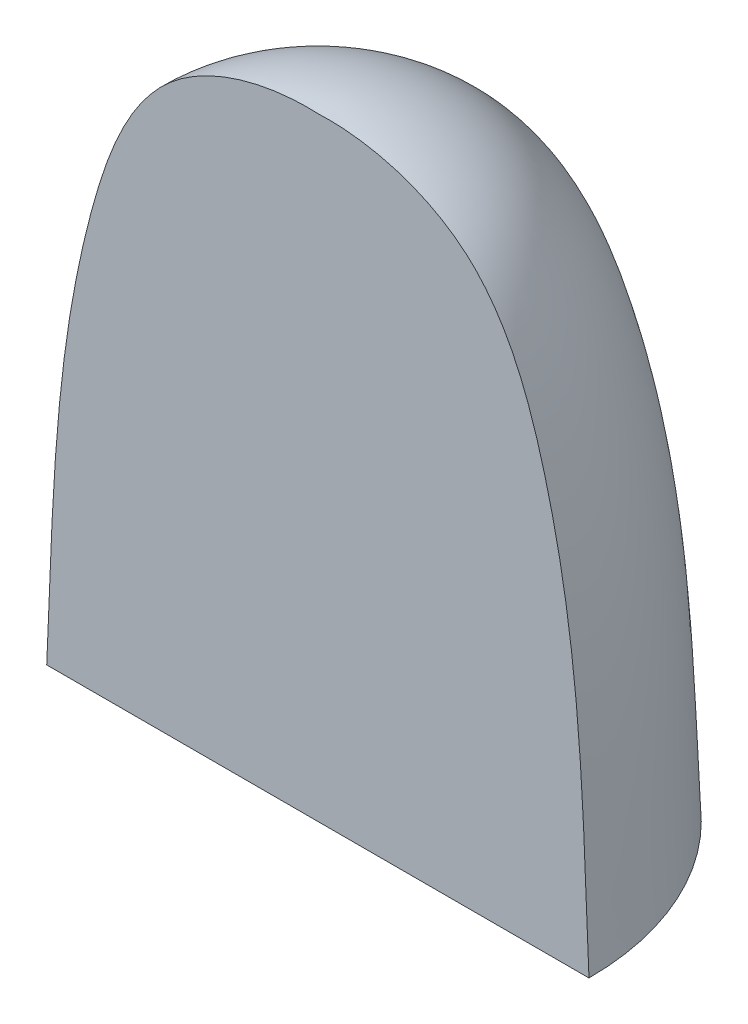
ISO-10303-21;
HEADER;
FILE_DESCRIPTION(('STEP AP214'),'2;1');
FILE_NAME('part.step','',(''),(''),'','','');
FILE_SCHEMA(('AUTOMOTIVE_DESIGN { 1 0 10303 214 1 1 1 1 }'));
ENDSEC;
DATA;
#1=APPLICATION_CONTEXT('core data for automotive mechanical design processes');
#2=APPLICATION_PROTOCOL_DEFINITION('international standard','automotive_design',2000,#1);
#3=PRODUCT_CONTEXT('',#1,'mechanical');
#4=PRODUCT('Part','Part','',(#3));
#5=PRODUCT_RELATED_PRODUCT_CATEGORY('part','',(#4));
#6=PRODUCT_DEFINITION_FORMATION('','',#4);
#7=PRODUCT_DEFINITION_CONTEXT('part definition',#1,'design');
#8=PRODUCT_DEFINITION('design','',#6,#7);
#9=PRODUCT_DEFINITION_SHAPE('','',#8);
#10=(LENGTH_UNIT() NAMED_UNIT(*) SI_UNIT(.MILLI.,.METRE.));
#11=(NAMED_UNIT(*) PLANE_ANGLE_UNIT() SI_UNIT($,.RADIAN.));
#12=(NAMED_UNIT(*) SI_UNIT($,.STERADIAN.) SOLID_ANGLE_UNIT());
#13=UNCERTAINTY_MEASURE_WITH_UNIT(LENGTH_MEASURE(1.E-05),#10,'distance_accuracy_value','');
#14=(GEOMETRIC_REPRESENTATION_CONTEXT(3) GLOBAL_UNCERTAINTY_ASSIGNED_CONTEXT((#13)) GLOBAL_UNIT_ASSIGNED_CONTEXT((#10,
#11,#12)) REPRESENTATION_CONTEXT('',''));
#15=CARTESIAN_POINT('',(0.,0.,0.));
#16=DIRECTION('',(0.,0.,1.));
#17=DIRECTION('',(1.,0.,0.));
#18=AXIS2_PLACEMENT_3D('',#15,#16,#17);
#19=CARTESIAN_POINT('',(0.,17.85,0.));
#20=CARTESIAN_POINT('',(1.24846861298638,18.0031040687306,0.));
#21=CARTESIAN_POINT('',(3.43429537377529,16.8333496800897,0.));
#22=CARTESIAN_POINT('',(6.61729731931612,10.514055415151,0.));
#23=CARTESIAN_POINT('',(6.22039885602234,4.53230718925359,0.));
#24=CARTESIAN_POINT('',(6.5,0.,0.));
#25=B_SPLINE_CURVE_WITH_KNOTS('',3,(#19,#20,#21,#22,#23,#24),.UNSPECIFIED.,.F.,.F.,(4,1,1,4),
(0.,0.174730571842795,0.328981961247271,1.),.UNSPECIFIED.);
#26=CARTESIAN_POINT('',(0.,24.0801939058172,0.));
#27=DIRECTION('',(0.,1.,0.));
#28=AXIS1_PLACEMENT('',#26,#27);
#29=SURFACE_OF_REVOLUTION('',#25,#28);
#30=CARTESIAN_POINT('',(-6.42261628933256,0.,-1.));
#31=CARTESIAN_POINT('',(-6.40999840737558,0.202144069037501,-1.));
#32=CARTESIAN_POINT('',(-6.39862298762293,0.404360225530453,-1.));
#33=CARTESIAN_POINT('',(-6.37786522635976,0.808885940270253,-1.));
#34=CARTESIAN_POINT('',(-6.3684827897175,1.01119549359677,-1.));
#35=CARTESIAN_POINT('',(-6.34242492153698,1.62198476605436,-1.));
#36=CARTESIAN_POINT('',(-6.32805579828116,2.0305597108176,-1.));
#37=CARTESIAN_POINT('',(-6.30152712698929,2.85051987310171,-1.));
#38=CARTESIAN_POINT('',(-6.2893830764119,3.26190552481192,-1.));
#39=CARTESIAN_POINT('',(-6.26366224801276,4.08630202744554,-1.));
#40=CARTESIAN_POINT('',(-6.25007987607228,4.49931272446483,-1.));
#41=CARTESIAN_POINT('',(-6.21782061477777,5.32576775294408,-1.));
#42=CARTESIAN_POINT('',(-6.1991361396311,5.73921180962271,-1.));
#43=CARTESIAN_POINT('',(-6.1521948556037,6.57970257299907,-1.));
#44=CARTESIAN_POINT('',(-6.12363388098088,7.00673329358906,-1.));
#45=CARTESIAN_POINT('',(-6.05303410165044,7.85867381750021,-1.));
#46=CARTESIAN_POINT('',(-6.01102835754578,8.28358625350202,-1.));
#47=CARTESIAN_POINT('',(-5.90944171168452,9.12998134820519,-1.));
#48=CARTESIAN_POINT('',(-5.84991790773198,9.55147064785064,-1.));
#49=CARTESIAN_POINT('',(-5.7092065861353,10.3896816415834,-1.));
#50=CARTESIAN_POINT('',(-5.62807933729757,10.806413286136,-1.));
#51=CARTESIAN_POINT('',(-5.44003731639687,11.6338666030697,-1.));
#52=CARTESIAN_POINT('',(-5.3331409204053,12.0445923379016,-0.999999999999999));
#53=CARTESIAN_POINT('',(-5.17361574848954,12.5776125719116,-1.));
#54=CARTESIAN_POINT('',(-5.13424663434977,12.7039420928548,-1.));
#55=CARTESIAN_POINT('',(-5.05252637885469,12.9557195338338,-1.));
#56=CARTESIAN_POINT('',(-5.01017350262703,13.0811668935466,-1.));
#57=CARTESIAN_POINT('',(-4.92240591057967,13.3310232714168,-1.));
#58=CARTESIAN_POINT('',(-4.87699041894009,13.4554320174358,-1.));
#59=CARTESIAN_POINT('',(-4.8065080410411,13.6411916912008,-1.));
#60=CARTESIAN_POINT('',(-4.78261270285467,13.7029889743352,-1.));
#61=CARTESIAN_POINT('',(-4.7340276019791,13.8262703325964,-1.));
#62=CARTESIAN_POINT('',(-4.70933783866417,13.8877544074764,-1.));
#63=CARTESIAN_POINT('',(-4.63396138085545,14.0716442880815,-1.));
#64=CARTESIAN_POINT('',(-4.58195710423236,14.1935153851383,-1.));
#65=CARTESIAN_POINT('',(-4.47378791119649,14.4354100975099,-1.));
#66=CARTESIAN_POINT('',(-4.41762284360768,14.5554336455053,-1.));
#67=CARTESIAN_POINT('',(-4.29951769516373,14.7950850391455,-1.));
#68=CARTESIAN_POINT('',(-4.23749763127219,14.9146736945553,-1.));
#69=CARTESIAN_POINT('',(-4.10782172505313,15.1507781678527,-1.));
#70=CARTESIAN_POINT('',(-4.04016564824958,15.2672938576295,-1.));
#71=CARTESIAN_POINT('',(-3.89858161520946,15.4965085965923,-1.));
#72=CARTESIAN_POINT('',(-3.82465218822982,15.6092067420687,-1.));
#73=CARTESIAN_POINT('',(-3.6702767933324,15.8294625018913,-1.));
#74=CARTESIAN_POINT('',(-3.58985540253065,15.9370372594243,-1.));
#75=CARTESIAN_POINT('',(-3.42189334517105,16.1464738050579,-1.));
#76=CARTESIAN_POINT('',(-3.33435389098538,16.2483365610726,-1.));
#77=CARTESIAN_POINT('',(-3.15199386499429,16.4452180483923,-1.));
#78=CARTESIAN_POINT('',(-3.05717845575063,16.5402415413145,-1.));
#79=CARTESIAN_POINT('',(-2.86916465126112,16.71441849979,-1.));
#80=CARTESIAN_POINT('',(-2.77657727593519,16.7942314439814,-1.));
#81=CARTESIAN_POINT('',(-2.5857092105719,16.9467296605872,-1.));
#82=CARTESIAN_POINT('',(-2.48742920625705,17.0194157886548,-1.));
#83=CARTESIAN_POINT('',(-2.28556893884342,17.1566932999947,-1.));
#84=CARTESIAN_POINT('',(-2.18199691142547,17.2212967521398,-1.));
#85=CARTESIAN_POINT('',(-1.96976843091663,17.3415790558771,-1.));
#86=CARTESIAN_POINT('',(-1.86111177645655,17.3972575536225,-1.));
#87=CARTESIAN_POINT('',(-1.63853535299575,17.4990221541799,-1.));
#88=CARTESIAN_POINT('',(-1.52458640545404,17.5450447308802,-1.));
#89=CARTESIAN_POINT('',(-1.29286926873105,17.6261758566657,-1.));
#90=CARTESIAN_POINT('',(-1.17510149309956,17.6612855831989,-1.));
#91=CARTESIAN_POINT('',(-0.936473393773838,17.7202490326539,-1.));
#92=CARTESIAN_POINT('',(-0.815606028256992,17.7440741836163,-1.));
#93=CARTESIAN_POINT('',(-0.572205343617627,17.7807954250336,-1.));
#94=CARTESIAN_POINT('',(-0.449671354526477,17.7936869799212,-1.));
#95=CARTESIAN_POINT('',(-0.21340062058319,17.809299632524,-1.));
#96=CARTESIAN_POINT('',(-0.0997069373888871,17.8127224603366,-1.));
#97=CARTESIAN_POINT('',(0.127650851780446,17.8120971892139,-1.));
#98=CARTESIAN_POINT('',(0.241314959649985,17.8080499424704,-1.));
#99=CARTESIAN_POINT('',(0.467849332744689,17.7917329740645,-1.));
#100=CARTESIAN_POINT('',(0.580720740450372,17.7794799453051,-1.));
#101=CARTESIAN_POINT('',(0.805059560982644,17.7456957746508,-1.));
#102=CARTESIAN_POINT('',(0.916527317150006,17.7241669488923,-1.));
#103=CARTESIAN_POINT('',(1.15155405126061,17.6679957702322,-1.));
#104=CARTESIAN_POINT('',(1.27479516410721,17.632009870832,-1.));
#105=CARTESIAN_POINT('',(1.51716789853898,17.5480877327227,-1.));
#106=CARTESIAN_POINT('',(1.63629807032919,17.5001473261037,-1.));
#107=CARTESIAN_POINT('',(1.86966339577367,17.3932427752455,-1.));
#108=CARTESIAN_POINT('',(1.9838922253933,17.334264886095,-1.));
#109=CARTESIAN_POINT('',(2.20671338376543,17.2064655586795,-1.));
#110=CARTESIAN_POINT('',(2.31530420788912,17.1376415109616,-1.));
#111=CARTESIAN_POINT('',(2.53951149442139,16.9821982743493,-1.));
#112=CARTESIAN_POINT('',(2.65433088339071,16.8944307794631,-1.));
#113=CARTESIAN_POINT('',(2.87590836958746,16.7092778113404,-1.));
#114=CARTESIAN_POINT('',(2.98266608166876,16.6118918790959,-1.));
#115=CARTESIAN_POINT('',(3.18776219117227,16.408579206145,-1.));
#116=CARTESIAN_POINT('',(3.28609774515059,16.3026496042245,-1.));
#117=CARTESIAN_POINT('',(3.47435485360609,16.0836026349269,-1.));
#118=CARTESIAN_POINT('',(3.56427620833487,15.9704850970193,-1.));
#119=CARTESIAN_POINT('',(3.78636705059933,15.6704189803899,-1.));
#120=CARTESIAN_POINT('',(3.91248433427453,15.478985340017,-1.));
#121=CARTESIAN_POINT('',(4.1471800187665,15.085619177292,-1.));
#122=CARTESIAN_POINT('',(4.25574300742439,14.8836776326821,-1.));
#123=CARTESIAN_POINT('',(4.40792608616691,14.575222747339,-1.));
#124=CARTESIAN_POINT('',(4.45694511386606,14.4713139148183,-1.));
#125=CARTESIAN_POINT('',(4.55178761609992,14.2620429582957,-1.));
#126=CARTESIAN_POINT('',(4.5976110360716,14.1566808095162,-1.));
#127=CARTESIAN_POINT('',(4.68647554251017,13.944827916199,-1.));
#128=CARTESIAN_POINT('',(4.72951733239565,13.8383374649776,-1.));
#129=CARTESIAN_POINT('',(4.81323710595821,13.6244319468778,-1.));
#130=CARTESIAN_POINT('',(4.85391504106031,13.5170168610512,-1.));
#131=CARTESIAN_POINT('',(4.96757018121328,13.2068170356862,-1.));
#132=CARTESIAN_POINT('',(5.03761233957419,13.0029494349116,-1.));
#133=CARTESIAN_POINT('',(5.16987075224262,12.5926884007881,-1.));
#134=CARTESIAN_POINT('',(5.23208639306786,12.3862947708258,-1.));
#135=CARTESIAN_POINT('',(5.34917344294296,11.9712266079175,-1.));
#136=CARTESIAN_POINT('',(5.40403782076221,11.7625500948747,-1.));
#137=CARTESIAN_POINT('',(5.50683059788724,11.3435106030181,-1.));
#138=CARTESIAN_POINT('',(5.55475909691136,11.1331476484964,-1.));
#139=CARTESIAN_POINT('',(5.6889365478829,10.4999007466791,-1.));
#140=CARTESIAN_POINT('',(5.76555017327309,10.0749574879904,-1.));
#141=CARTESIAN_POINT('',(5.89772611290117,9.21972095228717,-1.));
#142=CARTESIAN_POINT('',(5.95317982140009,8.78941147828326,-1.));
#143=CARTESIAN_POINT('',(6.04696920275435,7.9271692508611,-1.));
#144=CARTESIAN_POINT('',(6.08531223649522,7.49523727622989,-1.));
#145=CARTESIAN_POINT('',(6.14932484166554,6.63047475330309,-1.));
#146=CARTESIAN_POINT('',(6.17499423804612,6.19764419267912,-1.));
#147=CARTESIAN_POINT('',(6.22046614159332,5.28122187533568,-1.));
#148=CARTESIAN_POINT('',(6.23923879881637,4.79758233393546,-1.));
#149=CARTESIAN_POINT('',(6.27225788159768,3.83021868315066,-1.));
#150=CARTESIAN_POINT('',(6.28650475546868,3.34649458689439,-1.));
#151=CARTESIAN_POINT('',(6.31623268906044,2.38548145521528,-1.));
#152=CARTESIAN_POINT('',(6.33169492006705,1.908191978294,-0.999999999999999));
#153=CARTESIAN_POINT('',(6.36043005630438,1.19243190349366,-1.));
#154=CARTESIAN_POINT('',(6.37093308110639,0.95385601041782,-1.));
#155=CARTESIAN_POINT('',(6.39458787091519,0.4768208410554,-0.999999999999999));
#156=CARTESIAN_POINT('',(6.40773981549285,0.238361573774078,-0.999999999999997));
#157=CARTESIAN_POINT('',(6.42261628933256,0.,-0.999999999999992));
#158=B_SPLINE_CURVE_WITH_KNOTS('',3,(#30,#31,#32,#33,#34,#35,#36,#37,#38,#39,#40,#41,#42,#43,
#44,#45,#46,#47,#48,#49,#50,#51,#52,#53,#54,#55,#56,#57,#58,#59,#60,#61,#62,#63,#64,#65,#66,#67,
#68,#69,#70,#71,#72,#73,#74,#75,#76,#77,#78,#79,#80,#81,#82,#83,#84,#85,#86,#87,#88,#89,#90,#91,
#92,#93,#94,#95,#96,#97,#98,#99,#100,#101,#102,#103,#104,#105,#106,#107,#108,#109,#110,#111,
#112,#113,#114,#115,#116,#117,#118,#119,#120,#121,#122,#123,#124,#125,#126,#127,#128,#129,#130,
#131,#132,#133,#134,#135,#136,#137,#138,#139,#140,#141,#142,#143,#144,#145,#146,#147,#148,#149,
#150,#151,#152,#153,#154,#155,#156,#157),.UNSPECIFIED.,.F.,.F.,(4,2,2,2,2,2,2,2,2,2,2,2,2,2,2,2,
2,2,2,2,2,2,2,2,2,2,2,2,2,2,2,2,2,2,2,2,2,2,2,2,2,2,2,2,2,2,2,2,2,2,2,2,2,2,2,2,2,2,2,2,2,2,2,
4),(0.,0.607600927329956,1.21517284531686,2.44163004192293,3.67632914653922,4.91602023891663,
6.15756463171872,7.44136724781802,8.7220369464872,9.99857784637223,11.2715941276906,
12.5437052880018,12.9406448569127,13.3378171572839,13.7350904498138,13.9338543091148,
14.1326183249907,14.5300577884903,14.9275116994395,15.3315222071426,15.7355495313685,
16.1396718400679,16.5423301694522,16.9449200598158,17.3472268928785,17.7136257294065,
18.0799805216928,18.4457815814075,18.8115971404166,19.1797487426603,19.5478606091846,
19.9168995982495,20.2860916004342,20.6270793748566,20.9680282515405,21.3082856392783,
21.6484581150428,22.0329719438235,22.4176200203184,22.8027503231394,23.1879828838569,
23.6209564032631,24.053950594884,24.4870904001224,24.9202404852512,25.60674226431,
26.2938435371052,26.6384732328433,26.9831088114803,27.3276568948717,27.6722120558993,
28.3187207130151,28.9652800152346,29.612453380777,30.2596174408704,31.5542522872137,
32.8554453715612,34.1560781513887,35.4567288951138,36.9086820634573,38.3604913600829,
39.7930871251876,40.509494509365,41.225950475316),.UNSPECIFIED.);
#159=CARTESIAN_POINT('',(-6.42261628933256,0.,-1.));
#160=VERTEX_POINT('',#159);
#161=CARTESIAN_POINT('',(6.42261628933256,0.,-1.));
#162=VERTEX_POINT('',#161);
#163=EDGE_CURVE('E52',#160,#162,#158,.T.);
#164=ORIENTED_EDGE('',*,*,#163,.F.);
#165=CARTESIAN_POINT('',(0.,0.,0.));
#166=DIRECTION('',(0.,1.,0.));
#167=DIRECTION('',(0.,0.,1.));
#168=AXIS2_PLACEMENT_3D('',#165,#166,#167);
#169=CIRCLE('',#168,6.5);
#170=EDGE_CURVE('E55',#162,#160,#169,.T.);
#171=ORIENTED_EDGE('',*,*,#170,.F.);
#172=EDGE_LOOP('',(#164,#171));
#173=FACE_BOUND('',#172,.T.);
#174=ADVANCED_FACE('F35',(#173),#29,.T.);
#175=CARTESIAN_POINT('',(6.5,0.,0.));
#176=DIRECTION('',(0.,1.,0.));
#177=DIRECTION('',(0.,0.,1.));
#178=AXIS2_PLACEMENT_3D('',#175,#176,#177);
#179=PLANE('',#178);
#180=DIRECTION('',(1.,0.,0.));
#181=VECTOR('',#180,1.);
#182=CARTESIAN_POINT('',(-7.75,0.,-1.));
#183=LINE('',#182,#181);
#184=EDGE_CURVE('E105',#160,#162,#183,.T.);
#185=ORIENTED_EDGE('',*,*,#184,.T.);
#186=ORIENTED_EDGE('',*,*,#170,.T.);
#187=EDGE_LOOP('',(#185,#186));
#188=FACE_BOUND('',#187,.T.);
#189=DIRECTION('',(-1.,0.,0.));
#190=VECTOR('',#189,1.);
#191=CARTESIAN_POINT('',(6.5,0.,0.));
#192=LINE('',#191,#190);
#193=CARTESIAN_POINT('',(9.,0.,0.));
#194=VERTEX_POINT('',#193);
#195=CARTESIAN_POINT('',(-9.,0.,0.));
#196=VERTEX_POINT('',#195);
#197=EDGE_CURVE('E69',#194,#196,#192,.T.);
#198=ORIENTED_EDGE('',*,*,#197,.T.);
#199=CARTESIAN_POINT('',(0.,0.,0.));
#200=DIRECTION('',(0.,1.,0.));
#201=DIRECTION('',(0.,0.,1.));
#202=AXIS2_PLACEMENT_3D('',#199,#200,#201);
#203=CIRCLE('',#202,9.);
#204=EDGE_CURVE('E73',#194,#196,#203,.T.);
#205=ORIENTED_EDGE('',*,*,#204,.F.);
#206=EDGE_LOOP('',(#198,#205));
#207=FACE_BOUND('',#206,.T.);
#208=ADVANCED_FACE('F96',(#188,#207),#179,.F.);
#209=CARTESIAN_POINT('',(9.,0.,0.));
#210=CARTESIAN_POINT('',(8.79405712052161,4.78562399546529,0.));
#211=CARTESIAN_POINT('',(8.74052008463889,10.9419840515826,0.));
#212=CARTESIAN_POINT('',(5.66035992992067,19.3724701488857,0.));
#213=CARTESIAN_POINT('',(1.67596684179475,20.428176516065,0.));
#214=CARTESIAN_POINT('',(0.,20.35,0.));
#215=B_SPLINE_CURVE_WITH_KNOTS('',3,(#209,#210,#211,#212,#213,#214),.UNSPECIFIED.,.F.,.F.,(4,1,
1,4),(0.,0.559571261485386,0.790913026252223,1.),.UNSPECIFIED.);
#216=CARTESIAN_POINT('',(0.,24.0801939058172,0.));
#217=DIRECTION('',(0.,1.,0.));
#218=AXIS1_PLACEMENT('',#216,#217);
#219=SURFACE_OF_REVOLUTION('',#215,#218);
#220=ORIENTED_EDGE('',*,*,#204,.T.);
#221=CARTESIAN_POINT('',(-9.,0.,0.));
#222=CARTESIAN_POINT('',(-8.79405712052161,4.78562399546529,0.));
#223=CARTESIAN_POINT('',(-8.74052008463889,10.9419840515826,0.));
#224=CARTESIAN_POINT('',(-5.66035992992067,19.3724701488857,0.));
#225=CARTESIAN_POINT('',(-1.67596684179475,20.428176516065,0.));
#226=CARTESIAN_POINT('',(0.,20.35,0.));
#227=B_SPLINE_CURVE_WITH_KNOTS('',3,(#221,#222,#223,#224,#225,#226),.UNSPECIFIED.,.F.,.F.,(4,1,
1,4),(0.,0.559571261485386,0.790913026252223,1.),.UNSPECIFIED.);
#228=CARTESIAN_POINT('',(0.,20.35,0.));
#229=VERTEX_POINT('',#228);
#230=EDGE_CURVE('E11',#196,#229,#227,.T.);
#231=ORIENTED_EDGE('',*,*,#230,.T.);
#232=CARTESIAN_POINT('',(9.,0.,0.));
#233=CARTESIAN_POINT('',(8.79405712052161,4.78562399546529,0.));
#234=CARTESIAN_POINT('',(8.74052008463889,10.9419840515826,0.));
#235=CARTESIAN_POINT('',(5.66035992992067,19.3724701488857,0.));
#236=CARTESIAN_POINT('',(1.67596684179475,20.428176516065,0.));
#237=CARTESIAN_POINT('',(0.,20.35,0.));
#238=B_SPLINE_CURVE_WITH_KNOTS('',3,(#232,#233,#234,#235,#236,#237),.UNSPECIFIED.,.F.,.F.,(4,1,
1,4),(0.,0.559571261485386,0.790913026252223,1.),.UNSPECIFIED.);
#239=EDGE_CURVE('E46',#229,#194,#238,.F.);
#240=ORIENTED_EDGE('',*,*,#239,.T.);
#241=EDGE_LOOP('',(#220,#231,#240));
#242=FACE_BOUND('',#241,.T.);
#243=ADVANCED_FACE('F72',(#242),#219,.T.);
#244=CARTESIAN_POINT('',(0.,0.,0.));
#245=DIRECTION('',(0.,0.,-1.));
#246=DIRECTION('',(-1.,0.,0.));
#247=AXIS2_PLACEMENT_3D('',#244,#245,#246);
#248=PLANE('',#247);
#249=ORIENTED_EDGE('',*,*,#230,.F.);
#250=ORIENTED_EDGE('',*,*,#197,.F.);
#251=ORIENTED_EDGE('',*,*,#239,.F.);
#252=EDGE_LOOP('',(#249,#250,#251));
#253=FACE_BOUND('',#252,.T.);
#254=ADVANCED_FACE('F67',(#253),#248,.F.);
#255=CARTESIAN_POINT('',(-0.0875934879851533,19.1781359862039,-1.));
#256=DIRECTION('',(0.,0.,1.));
#257=DIRECTION('',(1.,0.,0.));
#258=AXIS2_PLACEMENT_3D('',#255,#256,#257);
#259=PLANE('',#258);
#260=ORIENTED_EDGE('',*,*,#184,.F.);
#261=ORIENTED_EDGE('',*,*,#163,.T.);
#262=EDGE_LOOP('',(#260,#261));
#263=FACE_BOUND('',#262,.T.);
#264=ADVANCED_FACE('F113',(#263),#259,.F.);
#265=CLOSED_SHELL('',(#174,#208,#243,#254,#264));
#266=MANIFOLD_SOLID_BREP('B2',#265);
#267=ADVANCED_BREP_SHAPE_REPRESENTATION('',(#18,#266),#14);
#268=SHAPE_DEFINITION_REPRESENTATION(#9,#267);
ENDSEC;
END-ISO-10303-21;
